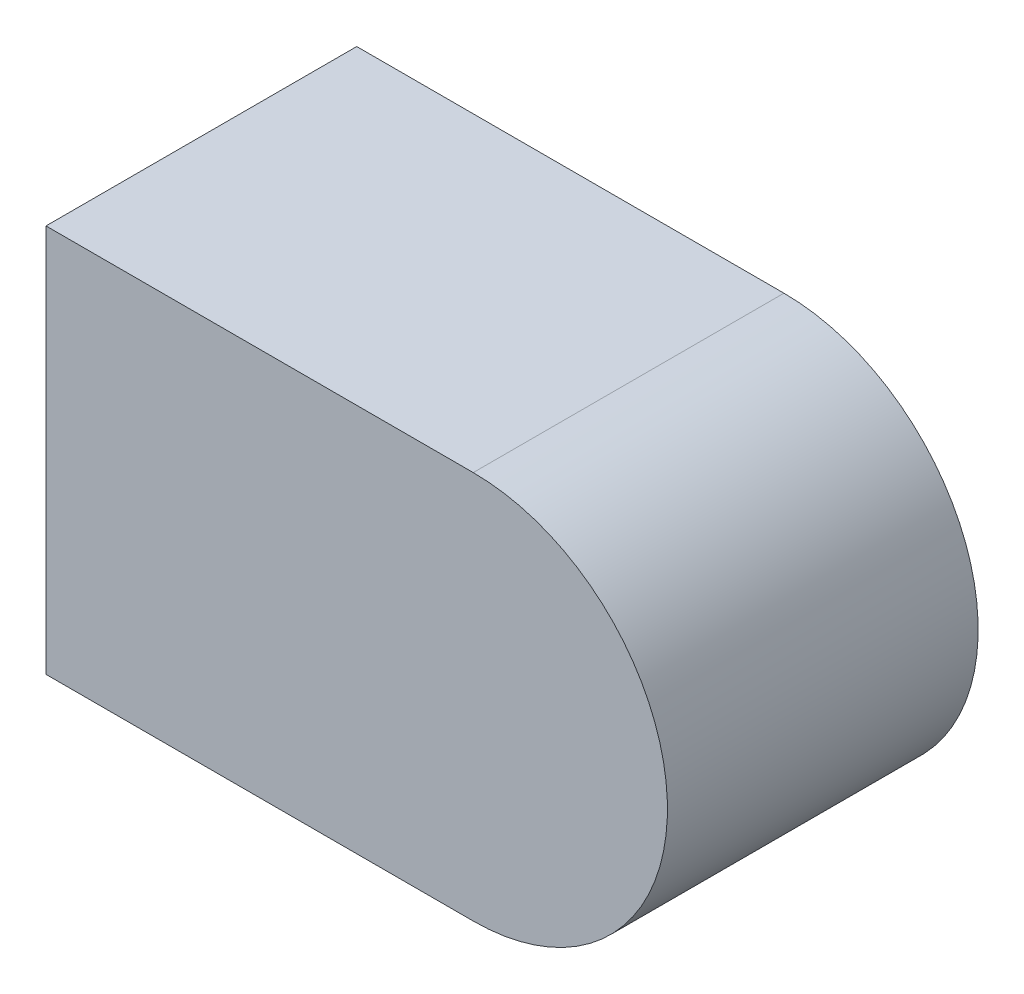
ISO-10303-21;
HEADER;
FILE_DESCRIPTION(('STEP AP214'),'2;1');
FILE_NAME('part.step','',(''),(''),'','','');
FILE_SCHEMA(('AUTOMOTIVE_DESIGN { 1 0 10303 214 1 1 1 1 }'));
ENDSEC;
DATA;
#1=APPLICATION_CONTEXT('core data for automotive mechanical design processes');
#2=APPLICATION_PROTOCOL_DEFINITION('international standard','automotive_design',2000,#1);
#3=PRODUCT_CONTEXT('',#1,'mechanical');
#4=PRODUCT('Part','Part','',(#3));
#5=PRODUCT_RELATED_PRODUCT_CATEGORY('part','',(#4));
#6=PRODUCT_DEFINITION_FORMATION('','',#4);
#7=PRODUCT_DEFINITION_CONTEXT('part definition',#1,'design');
#8=PRODUCT_DEFINITION('design','',#6,#7);
#9=PRODUCT_DEFINITION_SHAPE('','',#8);
#10=(LENGTH_UNIT() NAMED_UNIT(*) SI_UNIT(.MILLI.,.METRE.));
#11=(NAMED_UNIT(*) PLANE_ANGLE_UNIT() SI_UNIT($,.RADIAN.));
#12=(NAMED_UNIT(*) SI_UNIT($,.STERADIAN.) SOLID_ANGLE_UNIT());
#13=UNCERTAINTY_MEASURE_WITH_UNIT(LENGTH_MEASURE(1.E-05),#10,'distance_accuracy_value','');
#14=(GEOMETRIC_REPRESENTATION_CONTEXT(3) GLOBAL_UNCERTAINTY_ASSIGNED_CONTEXT((#13)) GLOBAL_UNIT_ASSIGNED_CONTEXT((#10,
#11,#12)) REPRESENTATION_CONTEXT('',''));
#15=CARTESIAN_POINT('',(0.,0.,0.));
#16=DIRECTION('',(0.,0.,1.));
#17=DIRECTION('',(1.,0.,0.));
#18=AXIS2_PLACEMENT_3D('',#15,#16,#17);
#19=CARTESIAN_POINT('',(-1.5,-0.125,0.));
#20=DIRECTION('',(0.,-1.,0.));
#21=DIRECTION('',(1.,0.,0.));
#22=AXIS2_PLACEMENT_3D('',#19,#20,#21);
#23=PLANE('',#22);
#24=DIRECTION('',(1.,0.,0.));
#25=VECTOR('',#24,1.);
#26=CARTESIAN_POINT('',(-1.5,-0.125,0.));
#27=LINE('',#26,#25);
#28=CARTESIAN_POINT('',(-1.5,-0.125,0.));
#29=VERTEX_POINT('',#28);
#30=CARTESIAN_POINT('',(-1.225,-0.125,0.));
#31=VERTEX_POINT('',#30);
#32=EDGE_CURVE('E11',#29,#31,#27,.T.);
#33=ORIENTED_EDGE('',*,*,#32,.T.);
#34=DIRECTION('',(0.,0.,1.));
#35=VECTOR('',#34,1.);
#36=CARTESIAN_POINT('',(-1.225,-0.125,0.));
#37=LINE('',#36,#35);
#38=CARTESIAN_POINT('',(-1.225,-0.125,0.2));
#39=VERTEX_POINT('',#38);
#40=EDGE_CURVE('E24',#31,#39,#37,.T.);
#41=ORIENTED_EDGE('',*,*,#40,.T.);
#42=DIRECTION('',(1.,0.,0.));
#43=VECTOR('',#42,1.);
#44=CARTESIAN_POINT('',(-1.5,-0.125,0.2));
#45=LINE('',#44,#43);
#46=CARTESIAN_POINT('',(-1.5,-0.125,0.2));
#47=VERTEX_POINT('',#46);
#48=EDGE_CURVE('E75',#47,#39,#45,.T.);
#49=ORIENTED_EDGE('',*,*,#48,.F.);
#50=DIRECTION('',(0.,0.,1.));
#51=VECTOR('',#50,1.);
#52=CARTESIAN_POINT('',(-1.5,-0.125,0.));
#53=LINE('',#52,#51);
#54=EDGE_CURVE('E86',#29,#47,#53,.T.);
#55=ORIENTED_EDGE('',*,*,#54,.F.);
#56=EDGE_LOOP('',(#33,#41,#49,#55));
#57=FACE_BOUND('',#56,.T.);
#58=ADVANCED_FACE('F17',(#57),#23,.T.);
#59=CARTESIAN_POINT('',(-1.5,0.125,0.));
#60=DIRECTION('',(-1.,0.,0.));
#61=DIRECTION('',(0.,-1.,0.));
#62=AXIS2_PLACEMENT_3D('',#59,#60,#61);
#63=PLANE('',#62);
#64=DIRECTION('',(0.,-1.,0.));
#65=VECTOR('',#64,1.);
#66=CARTESIAN_POINT('',(-1.5,0.125,0.));
#67=LINE('',#66,#65);
#68=CARTESIAN_POINT('',(-1.5,0.125,0.));
#69=VERTEX_POINT('',#68);
#70=EDGE_CURVE('E83',#69,#29,#67,.T.);
#71=ORIENTED_EDGE('',*,*,#70,.T.);
#72=ORIENTED_EDGE('',*,*,#54,.T.);
#73=DIRECTION('',(0.,-1.,0.));
#74=VECTOR('',#73,1.);
#75=CARTESIAN_POINT('',(-1.5,0.125,0.2));
#76=LINE('',#75,#74);
#77=CARTESIAN_POINT('',(-1.5,0.125,0.2));
#78=VERTEX_POINT('',#77);
#79=EDGE_CURVE('E81',#78,#47,#76,.T.);
#80=ORIENTED_EDGE('',*,*,#79,.F.);
#81=DIRECTION('',(0.,0.,1.));
#82=VECTOR('',#81,1.);
#83=CARTESIAN_POINT('',(-1.5,0.125,0.));
#84=LINE('',#83,#82);
#85=EDGE_CURVE('E61',#69,#78,#84,.T.);
#86=ORIENTED_EDGE('',*,*,#85,.F.);
#87=EDGE_LOOP('',(#71,#72,#80,#86));
#88=FACE_BOUND('',#87,.T.);
#89=ADVANCED_FACE('F91',(#88),#63,.T.);
#90=CARTESIAN_POINT('',(-1.225,0.125,0.));
#91=DIRECTION('',(0.,1.,0.));
#92=DIRECTION('',(-1.,0.,0.));
#93=AXIS2_PLACEMENT_3D('',#90,#91,#92);
#94=PLANE('',#93);
#95=DIRECTION('',(-1.,0.,0.));
#96=VECTOR('',#95,1.);
#97=CARTESIAN_POINT('',(-1.225,0.125,0.));
#98=LINE('',#97,#96);
#99=CARTESIAN_POINT('',(-1.225,0.125,0.));
#100=VERTEX_POINT('',#99);
#101=EDGE_CURVE('E65',#100,#69,#98,.T.);
#102=ORIENTED_EDGE('',*,*,#101,.T.);
#103=ORIENTED_EDGE('',*,*,#85,.T.);
#104=DIRECTION('',(-1.,0.,0.));
#105=VECTOR('',#104,1.);
#106=CARTESIAN_POINT('',(-1.225,0.125,0.2));
#107=LINE('',#106,#105);
#108=CARTESIAN_POINT('',(-1.225,0.125,0.2));
#109=VERTEX_POINT('',#108);
#110=EDGE_CURVE('E54',#109,#78,#107,.T.);
#111=ORIENTED_EDGE('',*,*,#110,.F.);
#112=DIRECTION('',(0.,0.,1.));
#113=VECTOR('',#112,1.);
#114=CARTESIAN_POINT('',(-1.225,0.125,0.));
#115=LINE('',#114,#113);
#116=EDGE_CURVE('E58',#100,#109,#115,.T.);
#117=ORIENTED_EDGE('',*,*,#116,.F.);
#118=EDGE_LOOP('',(#102,#103,#111,#117));
#119=FACE_BOUND('',#118,.T.);
#120=ADVANCED_FACE('F57',(#119),#94,.T.);
#121=CARTESIAN_POINT('',(-1.225,0.,0.));
#122=DIRECTION('',(0.,0.,1.));
#123=DIRECTION('',(0.,-1.,0.));
#124=AXIS2_PLACEMENT_3D('',#121,#122,#123);
#125=CYLINDRICAL_SURFACE('',#124,0.125);
#126=CARTESIAN_POINT('',(-1.225,0.,0.));
#127=DIRECTION('',(0.,0.,1.));
#128=DIRECTION('',(0.,-1.,0.));
#129=AXIS2_PLACEMENT_3D('',#126,#127,#128);
#130=CIRCLE('',#129,0.125);
#131=EDGE_CURVE('E71',#31,#100,#130,.T.);
#132=ORIENTED_EDGE('',*,*,#131,.T.);
#133=ORIENTED_EDGE('',*,*,#116,.T.);
#134=CARTESIAN_POINT('',(-1.225,0.,0.2));
#135=DIRECTION('',(0.,0.,1.));
#136=DIRECTION('',(0.,-1.,0.));
#137=AXIS2_PLACEMENT_3D('',#134,#135,#136);
#138=CIRCLE('',#137,0.125);
#139=EDGE_CURVE('E70',#39,#109,#138,.T.);
#140=ORIENTED_EDGE('',*,*,#139,.F.);
#141=ORIENTED_EDGE('',*,*,#40,.F.);
#142=EDGE_LOOP('',(#132,#133,#140,#141));
#143=FACE_BOUND('',#142,.T.);
#144=ADVANCED_FACE('F69',(#143),#125,.T.);
#145=CARTESIAN_POINT('',(-1.3,0.,0.2));
#146=DIRECTION('',(0.,0.,1.));
#147=DIRECTION('',(1.,0.,0.));
#148=AXIS2_PLACEMENT_3D('',#145,#146,#147);
#149=PLANE('',#148);
#150=ORIENTED_EDGE('',*,*,#139,.T.);
#151=ORIENTED_EDGE('',*,*,#110,.T.);
#152=ORIENTED_EDGE('',*,*,#79,.T.);
#153=ORIENTED_EDGE('',*,*,#48,.T.);
#154=EDGE_LOOP('',(#150,#151,#152,#153));
#155=FACE_BOUND('',#154,.T.);
#156=ADVANCED_FACE('F74',(#155),#149,.T.);
#157=CARTESIAN_POINT('',(-1.3,0.,0.));
#158=DIRECTION('',(0.,0.,1.));
#159=DIRECTION('',(1.,0.,0.));
#160=AXIS2_PLACEMENT_3D('',#157,#158,#159);
#161=PLANE('',#160);
#162=ORIENTED_EDGE('',*,*,#131,.F.);
#163=ORIENTED_EDGE('',*,*,#32,.F.);
#164=ORIENTED_EDGE('',*,*,#70,.F.);
#165=ORIENTED_EDGE('',*,*,#101,.F.);
#166=EDGE_LOOP('',(#162,#163,#164,#165));
#167=FACE_BOUND('',#166,.T.);
#168=ADVANCED_FACE('F89',(#167),#161,.F.);
#169=CLOSED_SHELL('',(#58,#89,#120,#144,#156,#168));
#170=MANIFOLD_SOLID_BREP('B1',#169);
#171=ADVANCED_BREP_SHAPE_REPRESENTATION('',(#18,#170),#14);
#172=SHAPE_DEFINITION_REPRESENTATION(#9,#171);
ENDSEC;
END-ISO-10303-21;
